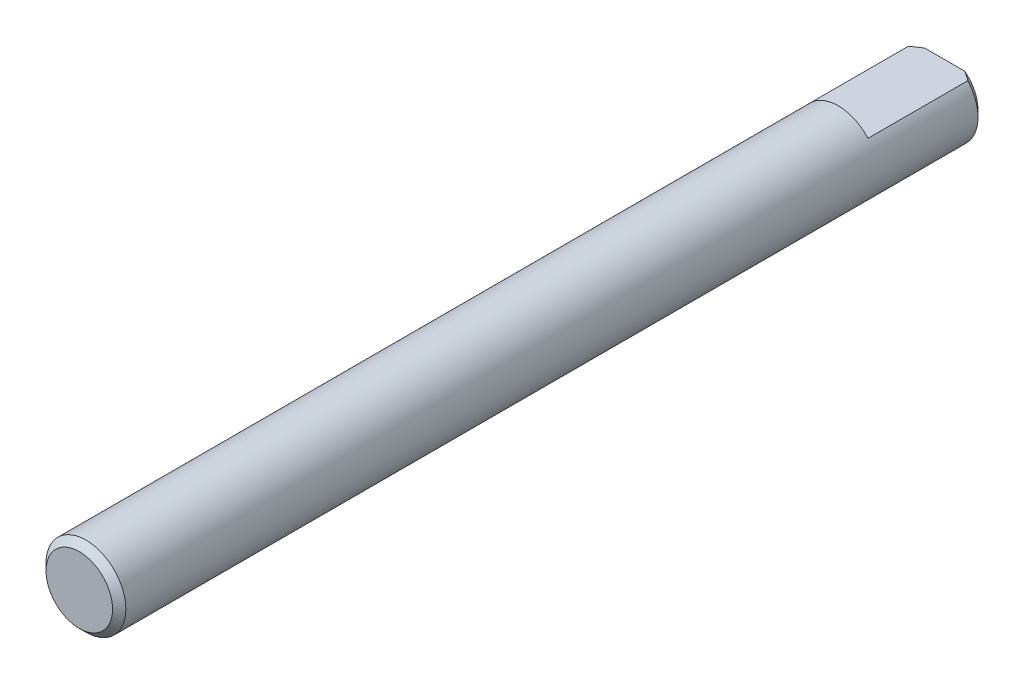
ISO-10303-21;
HEADER;
FILE_DESCRIPTION(('STEP AP214'),'2;1');
FILE_NAME('part.step','',(''),(''),'','','');
FILE_SCHEMA(('AUTOMOTIVE_DESIGN { 1 0 10303 214 1 1 1 1 }'));
ENDSEC;
DATA;
#1=APPLICATION_CONTEXT('core data for automotive mechanical design processes');
#2=APPLICATION_PROTOCOL_DEFINITION('international standard','automotive_design',2000,#1);
#3=PRODUCT_CONTEXT('',#1,'mechanical');
#4=PRODUCT('Part','Part','',(#3));
#5=PRODUCT_RELATED_PRODUCT_CATEGORY('part','',(#4));
#6=PRODUCT_DEFINITION_FORMATION('','',#4);
#7=PRODUCT_DEFINITION_CONTEXT('part definition',#1,'design');
#8=PRODUCT_DEFINITION('design','',#6,#7);
#9=PRODUCT_DEFINITION_SHAPE('','',#8);
#10=(LENGTH_UNIT() NAMED_UNIT(*) SI_UNIT(.MILLI.,.METRE.));
#11=(NAMED_UNIT(*) PLANE_ANGLE_UNIT() SI_UNIT($,.RADIAN.));
#12=(NAMED_UNIT(*) SI_UNIT($,.STERADIAN.) SOLID_ANGLE_UNIT());
#13=UNCERTAINTY_MEASURE_WITH_UNIT(LENGTH_MEASURE(1.E-05),#10,'distance_accuracy_value','');
#14=(GEOMETRIC_REPRESENTATION_CONTEXT(3) GLOBAL_UNCERTAINTY_ASSIGNED_CONTEXT((#13)) GLOBAL_UNIT_ASSIGNED_CONTEXT((#10,
#11,#12)) REPRESENTATION_CONTEXT('',''));
#15=CARTESIAN_POINT('',(0.,0.,0.));
#16=DIRECTION('',(0.,0.,1.));
#17=DIRECTION('',(1.,0.,0.));
#18=AXIS2_PLACEMENT_3D('',#15,#16,#17);
#19=CARTESIAN_POINT('',(0.,0.,32.5));
#20=DIRECTION('',(0.,0.,-1.));
#21=DIRECTION('',(-1.,0.,0.));
#22=AXIS2_PLACEMENT_3D('',#19,#20,#21);
#23=CYLINDRICAL_SURFACE('',#22,3.);
#24=CARTESIAN_POINT('',(0.,0.,32.));
#25=DIRECTION('',(0.,0.,1.));
#26=DIRECTION('',(1.,0.,0.));
#27=AXIS2_PLACEMENT_3D('',#24,#25,#26);
#28=CIRCLE('',#27,3.);
#29=CARTESIAN_POINT('',(3.,0.,32.));
#30=VERTEX_POINT('',#29);
#31=EDGE_CURVE('E99',#30,#30,#28,.F.);
#32=ORIENTED_EDGE('',*,*,#31,.T.);
#33=EDGE_LOOP('',(#32));
#34=FACE_BOUND('',#33,.T.);
#35=DIRECTION('',(0.,0.,-1.));
#36=VECTOR('',#35,1.);
#37=CARTESIAN_POINT('',(-2.23606797749979,2.,-24.5));
#38=LINE('',#37,#36);
#39=CARTESIAN_POINT('',(-2.23606797749979,2.,-24.5));
#40=VERTEX_POINT('',#39);
#41=CARTESIAN_POINT('',(-2.23606797749979,2.,-32.));
#42=VERTEX_POINT('',#41);
#43=EDGE_CURVE('E86',#40,#42,#38,.T.);
#44=ORIENTED_EDGE('',*,*,#43,.T.);
#45=CARTESIAN_POINT('',(0.,0.,-32.));
#46=DIRECTION('',(0.,0.,1.));
#47=DIRECTION('',(1.,0.,0.));
#48=AXIS2_PLACEMENT_3D('',#45,#46,#47);
#49=CIRCLE('',#48,3.);
#50=CARTESIAN_POINT('',(2.23606797749979,2.,-32.));
#51=VERTEX_POINT('',#50);
#52=EDGE_CURVE('E90',#42,#51,#49,.T.);
#53=ORIENTED_EDGE('',*,*,#52,.T.);
#54=DIRECTION('',(0.,0.,-1.));
#55=VECTOR('',#54,1.);
#56=CARTESIAN_POINT('',(2.23606797749979,2.,-24.5));
#57=LINE('',#56,#55);
#58=CARTESIAN_POINT('',(2.23606797749979,2.,-24.5));
#59=VERTEX_POINT('',#58);
#60=EDGE_CURVE('E85',#59,#51,#57,.T.);
#61=ORIENTED_EDGE('',*,*,#60,.F.);
#62=CARTESIAN_POINT('',(0.,0.,-24.5));
#63=DIRECTION('',(0.,0.,-1.));
#64=DIRECTION('',(-1.,0.,0.));
#65=AXIS2_PLACEMENT_3D('',#62,#63,#64);
#66=CIRCLE('',#65,3.);
#67=EDGE_CURVE('E75',#40,#59,#66,.T.);
#68=ORIENTED_EDGE('',*,*,#67,.F.);
#69=EDGE_LOOP('',(#44,#53,#61,#68));
#70=FACE_BOUND('',#69,.T.);
#71=ADVANCED_FACE('F41',(#34,#70),#23,.T.);
#72=CARTESIAN_POINT('',(0.,0.,32.5));
#73=DIRECTION('',(0.,0.,1.));
#74=DIRECTION('',(1.,0.,0.));
#75=AXIS2_PLACEMENT_3D('',#72,#73,#74);
#76=PLANE('',#75);
#77=CARTESIAN_POINT('',(0.,0.,32.5));
#78=DIRECTION('',(0.,0.,1.));
#79=DIRECTION('',(1.,0.,0.));
#80=AXIS2_PLACEMENT_3D('',#77,#78,#79);
#81=CIRCLE('',#80,2.5);
#82=CARTESIAN_POINT('',(2.5,0.,32.5));
#83=VERTEX_POINT('',#82);
#84=EDGE_CURVE('E92',#83,#83,#81,.T.);
#85=ORIENTED_EDGE('',*,*,#84,.T.);
#86=EDGE_LOOP('',(#85));
#87=FACE_BOUND('',#86,.T.);
#88=ADVANCED_FACE('F117',(#87),#76,.T.);
#89=CARTESIAN_POINT('',(0.,0.,-32.5));
#90=DIRECTION('',(0.,0.,1.));
#91=DIRECTION('',(1.,0.,0.));
#92=AXIS2_PLACEMENT_3D('',#89,#90,#91);
#93=PLANE('',#92);
#94=DIRECTION('',(-1.,0.,0.));
#95=VECTOR('',#94,1.);
#96=CARTESIAN_POINT('',(2.23606797749979,2.,-32.5));
#97=LINE('',#96,#95);
#98=CARTESIAN_POINT('',(1.50000000000002,2.,-32.5));
#99=VERTEX_POINT('',#98);
#100=CARTESIAN_POINT('',(-1.50000000000002,2.,-32.5));
#101=VERTEX_POINT('',#100);
#102=EDGE_CURVE('E82',#99,#101,#97,.T.);
#103=ORIENTED_EDGE('',*,*,#102,.F.);
#104=CARTESIAN_POINT('',(0.,0.,-32.5));
#105=DIRECTION('',(0.,0.,1.));
#106=DIRECTION('',(1.,0.,0.));
#107=AXIS2_PLACEMENT_3D('',#104,#105,#106);
#108=CIRCLE('',#107,2.50000000000001);
#109=EDGE_CURVE('E11',#99,#101,#108,.F.);
#110=ORIENTED_EDGE('',*,*,#109,.T.);
#111=EDGE_LOOP('',(#103,#110));
#112=FACE_BOUND('',#111,.T.);
#113=ADVANCED_FACE('F116',(#112),#93,.F.);
#114=CARTESIAN_POINT('',(2.23606797749979,2.,-24.5));
#115=DIRECTION('',(0.,-1.,0.));
#116=DIRECTION('',(0.,0.,-1.));
#117=AXIS2_PLACEMENT_3D('',#114,#115,#116);
#118=PLANE('',#117);
#119=ORIENTED_EDGE('',*,*,#60,.T.);
#120=CARTESIAN_POINT('',(2.23606797749979,2.,-32.));
#121=CARTESIAN_POINT('',(2.17657340830977,2.,-32.0443329228987));
#122=CARTESIAN_POINT('',(2.11670900846293,2.,-32.0881782263033));
#123=CARTESIAN_POINT('',(1.99613946258493,2.,-32.1746166557635));
#124=CARTESIAN_POINT('',(1.93543485253754,2.,-32.2172105304513));
#125=CARTESIAN_POINT('',(1.81300116191588,2.,-32.300930975112));
#126=CARTESIAN_POINT('',(1.75127191097626,2.,-32.3420572974233));
#127=CARTESIAN_POINT('',(1.62658889898816,2.,-32.4224920359348));
#128=CARTESIAN_POINT('',(1.56363441041137,2.,-32.4617993221427));
#129=CARTESIAN_POINT('',(1.50000000000001,2.,-32.5));
#130=B_SPLINE_CURVE_WITH_KNOTS('',3,(#120,#121,#122,#123,#124,#125,#126,#127,#128,#129),
.UNSPECIFIED.,.F.,.F.,(4,2,2,2,4),(0.,0.2225921176508,0.445048246319032,0.667541740446216,
0.890171642368361),.UNSPECIFIED.);
#131=EDGE_CURVE('E51',#51,#99,#130,.T.);
#132=ORIENTED_EDGE('',*,*,#131,.T.);
#133=ORIENTED_EDGE('',*,*,#102,.T.);
#134=CARTESIAN_POINT('',(-1.50000000000002,2.,-32.5));
#135=CARTESIAN_POINT('',(-1.56363441041137,2.,-32.4617993221427));
#136=CARTESIAN_POINT('',(-1.62658889898817,2.,-32.4224920359349));
#137=CARTESIAN_POINT('',(-1.75127191097626,2.,-32.3420572974233));
#138=CARTESIAN_POINT('',(-1.81300116191588,2.,-32.300930975112));
#139=CARTESIAN_POINT('',(-1.93543485253754,2.,-32.2172105304513));
#140=CARTESIAN_POINT('',(-1.99613946258492,2.,-32.1746166557635));
#141=CARTESIAN_POINT('',(-2.11670900846293,2.,-32.0881782263034));
#142=CARTESIAN_POINT('',(-2.17657340830977,2.,-32.0443329228987));
#143=CARTESIAN_POINT('',(-2.23606797749979,2.,-32.));
#144=B_SPLINE_CURVE_WITH_KNOTS('',3,(#134,#135,#136,#137,#138,#139,#140,#141,#142,#143),
.UNSPECIFIED.,.F.,.F.,(4,2,2,2,4),(0.,0.222629901922139,0.445123396049328,0.667579524717553,
0.890171642368359),.UNSPECIFIED.);
#145=EDGE_CURVE('E102',#101,#42,#144,.T.);
#146=ORIENTED_EDGE('',*,*,#145,.T.);
#147=ORIENTED_EDGE('',*,*,#43,.F.);
#148=DIRECTION('',(-1.,0.,0.));
#149=VECTOR('',#148,1.);
#150=CARTESIAN_POINT('',(2.23606797749979,2.,-24.5));
#151=LINE('',#150,#149);
#152=EDGE_CURVE('E78',#59,#40,#151,.T.);
#153=ORIENTED_EDGE('',*,*,#152,.F.);
#154=EDGE_LOOP('',(#119,#132,#133,#146,#147,#153));
#155=FACE_BOUND('',#154,.T.);
#156=ADVANCED_FACE('F84',(#155),#118,.F.);
#157=CARTESIAN_POINT('',(0.,0.,-24.5));
#158=DIRECTION('',(0.,0.,-1.));
#159=DIRECTION('',(-1.,0.,0.));
#160=AXIS2_PLACEMENT_3D('',#157,#158,#159);
#161=PLANE('',#160);
#162=ORIENTED_EDGE('',*,*,#67,.T.);
#163=ORIENTED_EDGE('',*,*,#152,.T.);
#164=EDGE_LOOP('',(#162,#163));
#165=FACE_BOUND('',#164,.T.);
#166=ADVANCED_FACE('F77',(#165),#161,.T.);
#167=CARTESIAN_POINT('',(0.,0.,32.5));
#168=DIRECTION('',(0.,0.,-1.));
#169=DIRECTION('',(-1.,0.,0.));
#170=AXIS2_PLACEMENT_3D('',#167,#168,#169);
#171=CONICAL_SURFACE('',#170,2.5,0.785398163397452);
#172=ORIENTED_EDGE('',*,*,#31,.F.);
#173=EDGE_LOOP('',(#172));
#174=FACE_BOUND('',#173,.T.);
#175=ORIENTED_EDGE('',*,*,#84,.F.);
#176=EDGE_LOOP('',(#175));
#177=FACE_BOUND('',#176,.T.);
#178=ADVANCED_FACE('F127',(#174,#177),#171,.T.);
#179=CARTESIAN_POINT('',(0.,0.,-32.));
#180=DIRECTION('',(0.,0.,1.));
#181=DIRECTION('',(1.,0.,0.));
#182=AXIS2_PLACEMENT_3D('',#179,#180,#181);
#183=CONICAL_SURFACE('',#182,3.,0.785398163397438);
#184=ORIENTED_EDGE('',*,*,#145,.F.);
#185=ORIENTED_EDGE('',*,*,#109,.F.);
#186=ORIENTED_EDGE('',*,*,#131,.F.);
#187=ORIENTED_EDGE('',*,*,#52,.F.);
#188=EDGE_LOOP('',(#184,#185,#186,#187));
#189=FACE_BOUND('',#188,.T.);
#190=ADVANCED_FACE('F44',(#189),#183,.T.);
#191=CLOSED_SHELL('',(#71,#88,#113,#156,#166,#178,#190));
#192=MANIFOLD_SOLID_BREP('B2',#191);
#193=ADVANCED_BREP_SHAPE_REPRESENTATION('',(#18,#192),#14);
#194=SHAPE_DEFINITION_REPRESENTATION(#9,#193);
ENDSEC;
END-ISO-10303-21;
